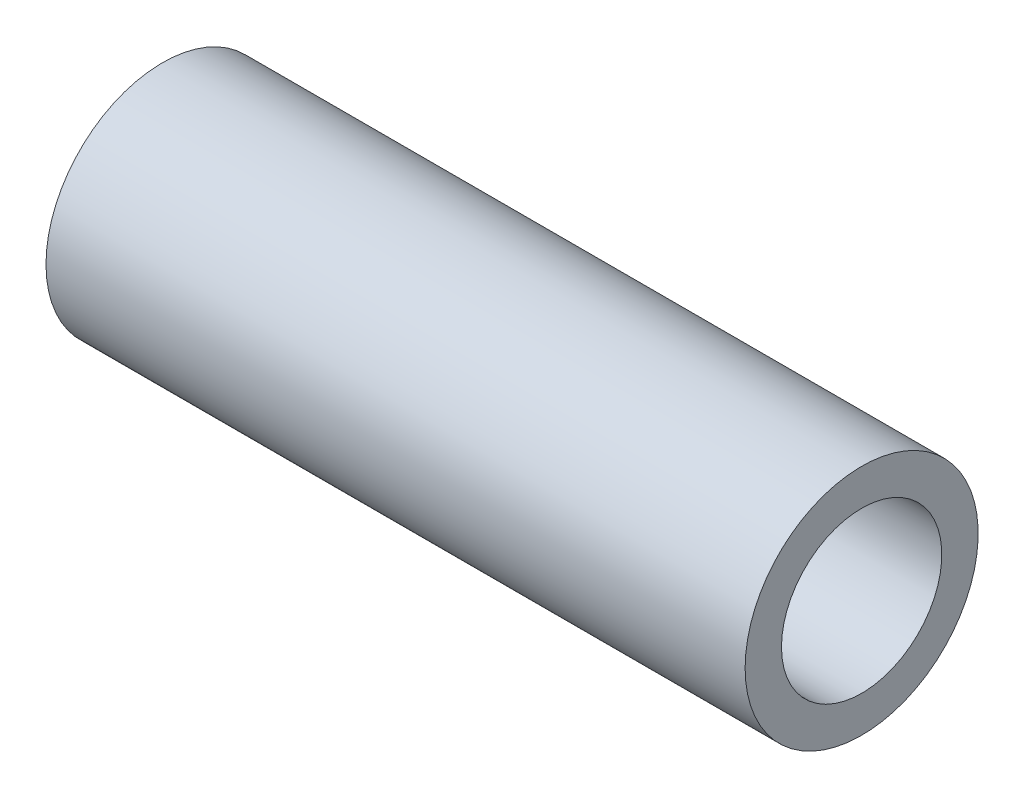
ISO-10303-21;
HEADER;
FILE_DESCRIPTION(('STEP AP214'),'2;1');
FILE_NAME('part.step','',(''),(''),'','','');
FILE_SCHEMA(('AUTOMOTIVE_DESIGN { 1 0 10303 214 1 1 1 1 }'));
ENDSEC;
DATA;
#1=APPLICATION_CONTEXT('core data for automotive mechanical design processes');
#2=APPLICATION_PROTOCOL_DEFINITION('international standard','automotive_design',2000,#1);
#3=PRODUCT_CONTEXT('',#1,'mechanical');
#4=PRODUCT('Part','Part','',(#3));
#5=PRODUCT_RELATED_PRODUCT_CATEGORY('part','',(#4));
#6=PRODUCT_DEFINITION_FORMATION('','',#4);
#7=PRODUCT_DEFINITION_CONTEXT('part definition',#1,'design');
#8=PRODUCT_DEFINITION('design','',#6,#7);
#9=PRODUCT_DEFINITION_SHAPE('','',#8);
#10=(LENGTH_UNIT() NAMED_UNIT(*) SI_UNIT(.MILLI.,.METRE.));
#11=(NAMED_UNIT(*) PLANE_ANGLE_UNIT() SI_UNIT($,.RADIAN.));
#12=(NAMED_UNIT(*) SI_UNIT($,.STERADIAN.) SOLID_ANGLE_UNIT());
#13=UNCERTAINTY_MEASURE_WITH_UNIT(LENGTH_MEASURE(1.E-05),#10,'distance_accuracy_value','');
#14=(GEOMETRIC_REPRESENTATION_CONTEXT(3) GLOBAL_UNCERTAINTY_ASSIGNED_CONTEXT((#13)) GLOBAL_UNIT_ASSIGNED_CONTEXT((#10,
#11,#12)) REPRESENTATION_CONTEXT('',''));
#15=CARTESIAN_POINT('',(0.,0.,0.));
#16=DIRECTION('',(0.,0.,1.));
#17=DIRECTION('',(1.,0.,0.));
#18=AXIS2_PLACEMENT_3D('',#15,#16,#17);
#19=CARTESIAN_POINT('',(19.05,0.,0.));
#20=DIRECTION('',(-1.,0.,0.));
#21=DIRECTION('',(0.,0.,1.));
#22=AXIS2_PLACEMENT_3D('',#19,#20,#21);
#23=CYLINDRICAL_SURFACE('',#22,2.1844);
#24=CARTESIAN_POINT('',(0.,0.,0.));
#25=DIRECTION('',(-1.,0.,0.));
#26=DIRECTION('',(0.,0.,1.));
#27=AXIS2_PLACEMENT_3D('',#24,#25,#26);
#28=CIRCLE('',#27,2.1844);
#29=CARTESIAN_POINT('',(0.,0.,2.1844));
#30=VERTEX_POINT('',#29);
#31=EDGE_CURVE('E27',#30,#30,#28,.T.);
#32=ORIENTED_EDGE('',*,*,#31,.T.);
#33=EDGE_LOOP('',(#32));
#34=FACE_BOUND('',#33,.T.);
#35=CARTESIAN_POINT('',(19.05,0.,0.));
#36=DIRECTION('',(-1.,0.,0.));
#37=DIRECTION('',(0.,0.,1.));
#38=AXIS2_PLACEMENT_3D('',#35,#36,#37);
#39=CIRCLE('',#38,2.1844);
#40=CARTESIAN_POINT('',(19.05,0.,2.1844));
#41=VERTEX_POINT('',#40);
#42=EDGE_CURVE('E18',#41,#41,#39,.T.);
#43=ORIENTED_EDGE('',*,*,#42,.F.);
#44=EDGE_LOOP('',(#43));
#45=FACE_BOUND('',#44,.T.);
#46=ADVANCED_FACE('F15',(#34,#45),#23,.F.);
#47=CARTESIAN_POINT('',(19.05,0.,0.));
#48=DIRECTION('',(1.,0.,0.));
#49=DIRECTION('',(0.,0.,-1.));
#50=AXIS2_PLACEMENT_3D('',#47,#48,#49);
#51=PLANE('',#50);
#52=ORIENTED_EDGE('',*,*,#42,.T.);
#53=EDGE_LOOP('',(#52));
#54=FACE_BOUND('',#53,.T.);
#55=CARTESIAN_POINT('',(19.05,0.,0.));
#56=DIRECTION('',(-1.,0.,0.));
#57=DIRECTION('',(0.,0.,1.));
#58=AXIS2_PLACEMENT_3D('',#55,#56,#57);
#59=CIRCLE('',#58,3.175);
#60=CARTESIAN_POINT('',(19.05,0.,3.175));
#61=VERTEX_POINT('',#60);
#62=EDGE_CURVE('E22',#61,#61,#59,.T.);
#63=ORIENTED_EDGE('',*,*,#62,.F.);
#64=EDGE_LOOP('',(#63));
#65=FACE_BOUND('',#64,.T.);
#66=ADVANCED_FACE('F35',(#54,#65),#51,.T.);
#67=CARTESIAN_POINT('',(0.,0.,0.));
#68=DIRECTION('',(1.,0.,0.));
#69=DIRECTION('',(0.,0.,-1.));
#70=AXIS2_PLACEMENT_3D('',#67,#68,#69);
#71=PLANE('',#70);
#72=ORIENTED_EDGE('',*,*,#31,.F.);
#73=EDGE_LOOP('',(#72));
#74=FACE_BOUND('',#73,.T.);
#75=CARTESIAN_POINT('',(0.,0.,0.));
#76=DIRECTION('',(-1.,0.,0.));
#77=DIRECTION('',(0.,0.,1.));
#78=AXIS2_PLACEMENT_3D('',#75,#76,#77);
#79=CIRCLE('',#78,3.175);
#80=CARTESIAN_POINT('',(0.,0.,3.175));
#81=VERTEX_POINT('',#80);
#82=EDGE_CURVE('E10',#81,#81,#79,.F.);
#83=ORIENTED_EDGE('',*,*,#82,.F.);
#84=EDGE_LOOP('',(#83));
#85=FACE_BOUND('',#84,.T.);
#86=ADVANCED_FACE('F43',(#74,#85),#71,.F.);
#87=CARTESIAN_POINT('',(19.05,0.,0.));
#88=DIRECTION('',(-1.,0.,0.));
#89=DIRECTION('',(0.,0.,1.));
#90=AXIS2_PLACEMENT_3D('',#87,#88,#89);
#91=CYLINDRICAL_SURFACE('',#90,3.175);
#92=ORIENTED_EDGE('',*,*,#82,.T.);
#93=EDGE_LOOP('',(#92));
#94=FACE_BOUND('',#93,.T.);
#95=ORIENTED_EDGE('',*,*,#62,.T.);
#96=EDGE_LOOP('',(#95));
#97=FACE_BOUND('',#96,.T.);
#98=ADVANCED_FACE('F44',(#94,#97),#91,.T.);
#99=CLOSED_SHELL('',(#46,#66,#86,#98));
#100=MANIFOLD_SOLID_BREP('B1',#99);
#101=ADVANCED_BREP_SHAPE_REPRESENTATION('',(#18,#100),#14);
#102=SHAPE_DEFINITION_REPRESENTATION(#9,#101);
ENDSEC;
END-ISO-10303-21;
